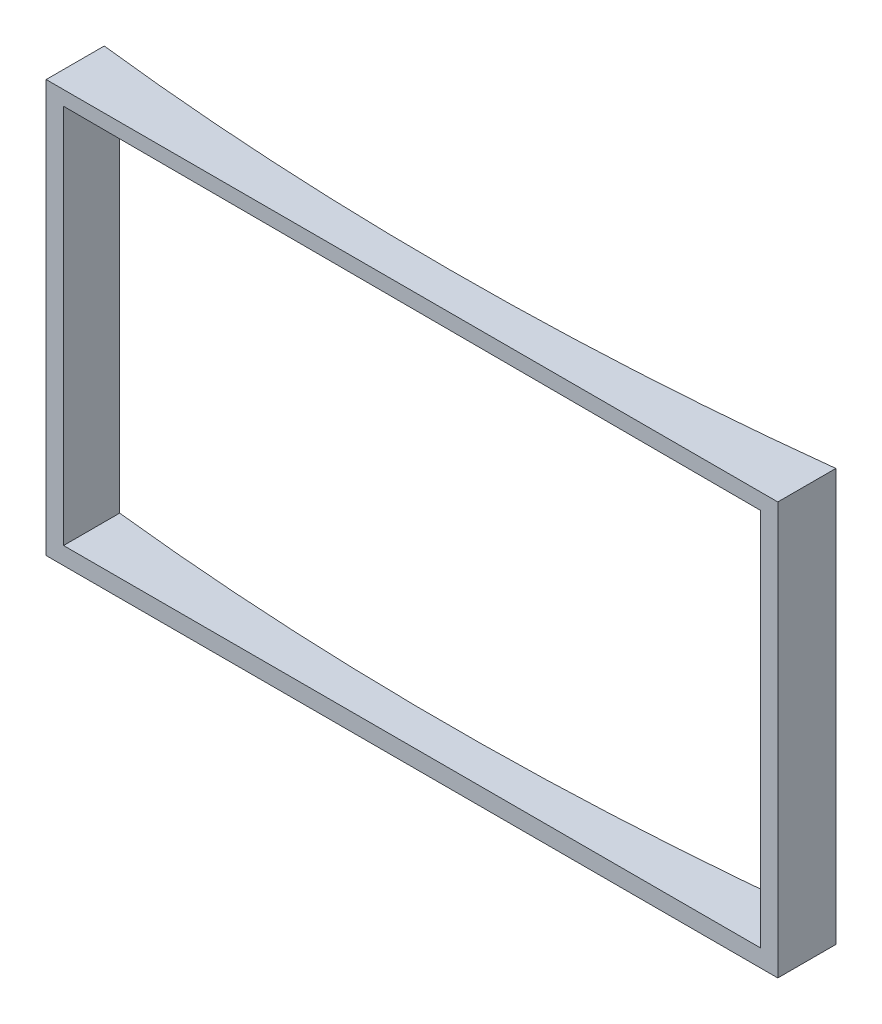
ISO-10303-21;
HEADER;
FILE_DESCRIPTION(('STEP AP214'),'2;1');
FILE_NAME('part.step','',(''),(''),'','','');
FILE_SCHEMA(('AUTOMOTIVE_DESIGN { 1 0 10303 214 1 1 1 1 }'));
ENDSEC;
DATA;
#1=APPLICATION_CONTEXT('core data for automotive mechanical design processes');
#2=APPLICATION_PROTOCOL_DEFINITION('international standard','automotive_design',2000,#1);
#3=PRODUCT_CONTEXT('',#1,'mechanical');
#4=PRODUCT('Part','Part','',(#3));
#5=PRODUCT_RELATED_PRODUCT_CATEGORY('part','',(#4));
#6=PRODUCT_DEFINITION_FORMATION('','',#4);
#7=PRODUCT_DEFINITION_CONTEXT('part definition',#1,'design');
#8=PRODUCT_DEFINITION('design','',#6,#7);
#9=PRODUCT_DEFINITION_SHAPE('','',#8);
#10=(LENGTH_UNIT() NAMED_UNIT(*) SI_UNIT(.MILLI.,.METRE.));
#11=(NAMED_UNIT(*) PLANE_ANGLE_UNIT() SI_UNIT($,.RADIAN.));
#12=(NAMED_UNIT(*) SI_UNIT($,.STERADIAN.) SOLID_ANGLE_UNIT());
#13=UNCERTAINTY_MEASURE_WITH_UNIT(LENGTH_MEASURE(1.E-05),#10,'distance_accuracy_value','');
#14=(GEOMETRIC_REPRESENTATION_CONTEXT(3) GLOBAL_UNCERTAINTY_ASSIGNED_CONTEXT((#13)) GLOBAL_UNIT_ASSIGNED_CONTEXT((#10,
#11,#12)) REPRESENTATION_CONTEXT('',''));
#15=CARTESIAN_POINT('',(0.,0.,0.));
#16=DIRECTION('',(0.,0.,1.));
#17=DIRECTION('',(1.,0.,0.));
#18=AXIS2_PLACEMENT_3D('',#15,#16,#17);
#19=CARTESIAN_POINT('',(8890.54648049518,3550.,3013.60985692235));
#20=DIRECTION('',(-1.,0.,0.));
#21=DIRECTION('',(0.,0.,1.));
#22=AXIS2_PLACEMENT_3D('',#19,#20,#21);
#23=PLANE('',#22);
#24=DIRECTION('',(0.,0.,-1.));
#25=VECTOR('',#24,1.);
#26=CARTESIAN_POINT('',(8890.54648049518,0.,3013.60985692235));
#27=LINE('',#26,#25);
#28=CARTESIAN_POINT('',(8890.54648049518,0.,3013.60985692235));
#29=VERTEX_POINT('',#28);
#30=CARTESIAN_POINT('',(8890.54648049518,0.,2513.60985692235));
#31=VERTEX_POINT('',#30);
#32=EDGE_CURVE('E158',#29,#31,#27,.T.);
#33=ORIENTED_EDGE('',*,*,#32,.T.);
#34=DIRECTION('',(0.,-1.,0.));
#35=VECTOR('',#34,1.);
#36=CARTESIAN_POINT('',(8890.54648049518,3550.,2513.60985692235));
#37=LINE('',#36,#35);
#38=CARTESIAN_POINT('',(8890.54648049518,3550.,2513.60985692235));
#39=VERTEX_POINT('',#38);
#40=EDGE_CURVE('E11',#39,#31,#37,.T.);
#41=ORIENTED_EDGE('',*,*,#40,.F.);
#42=DIRECTION('',(0.,0.,-1.));
#43=VECTOR('',#42,1.);
#44=CARTESIAN_POINT('',(8890.54648049518,3550.,3013.60985692235));
#45=LINE('',#44,#43);
#46=CARTESIAN_POINT('',(8890.54648049518,3550.,3013.60985692235));
#47=VERTEX_POINT('',#46);
#48=EDGE_CURVE('E159',#47,#39,#45,.T.);
#49=ORIENTED_EDGE('',*,*,#48,.F.);
#50=DIRECTION('',(0.,-1.,0.));
#51=VECTOR('',#50,1.);
#52=CARTESIAN_POINT('',(8890.54648049518,3550.,3013.60985692235));
#53=LINE('',#52,#51);
#54=EDGE_CURVE('E173',#47,#29,#53,.T.);
#55=ORIENTED_EDGE('',*,*,#54,.T.);
#56=EDGE_LOOP('',(#33,#41,#49,#55));
#57=FACE_BOUND('',#56,.T.);
#58=ADVANCED_FACE('F45',(#57),#23,.F.);
#59=CARTESIAN_POINT('',(5740.54648049518,3550.,-24805.385366182));
#60=DIRECTION('',(0.,-1.,0.));
#61=DIRECTION('',(0.,0.,-1.));
#62=AXIS2_PLACEMENT_3D('',#59,#60,#61);
#63=CYLINDRICAL_SURFACE('',#62,27500.);
#64=CARTESIAN_POINT('',(5740.54648049518,150.,-24805.385366182));
#65=DIRECTION('',(0.,-1.,0.));
#66=DIRECTION('',(1.,0.,0.));
#67=AXIS2_PLACEMENT_3D('',#64,#65,#66);
#68=CIRCLE('',#67,27500.);
#69=CARTESIAN_POINT('',(2740.54648049518,150.,2530.48849949126));
#70=VERTEX_POINT('',#69);
#71=CARTESIAN_POINT('',(8740.54648049518,150.,2530.48849949126));
#72=VERTEX_POINT('',#71);
#73=EDGE_CURVE('E150',#70,#72,#68,.F.);
#74=ORIENTED_EDGE('',*,*,#73,.T.);
#75=DIRECTION('',(0.,-1.,0.));
#76=VECTOR('',#75,1.);
#77=CARTESIAN_POINT('',(8740.54648049518,3550.,2530.48849949126));
#78=LINE('',#77,#76);
#79=CARTESIAN_POINT('',(8740.54648049518,3412.63855525021,2530.48849949125));
#80=VERTEX_POINT('',#79);
#81=EDGE_CURVE('E154',#72,#80,#78,.F.);
#82=ORIENTED_EDGE('',*,*,#81,.T.);
#83=CARTESIAN_POINT('',(5740.54648049518,3419.1282100401,-24805.385366182));
#84=DIRECTION('',(0.00216321320190937,0.999997660251584,0.));
#85=DIRECTION('',(0.999997660251584,-0.00216321320190937,0.));
#86=AXIS2_PLACEMENT_3D('',#83,#84,#85);
#87=ELLIPSE('',#86,27500.064343232,27500.);
#88=CARTESIAN_POINT('',(2740.54648049518,3425.61786482999,2530.48849949125));
#89=VERTEX_POINT('',#88);
#90=EDGE_CURVE('E141',#80,#89,#87,.F.);
#91=ORIENTED_EDGE('',*,*,#90,.T.);
#92=DIRECTION('',(0.,-1.,0.));
#93=VECTOR('',#92,1.);
#94=CARTESIAN_POINT('',(2740.54648049518,3550.,2530.48849949126));
#95=LINE('',#94,#93);
#96=EDGE_CURVE('E116',#89,#70,#95,.T.);
#97=ORIENTED_EDGE('',*,*,#96,.T.);
#98=EDGE_LOOP('',(#74,#82,#91,#97));
#99=FACE_BOUND('',#98,.T.);
#100=CARTESIAN_POINT('',(5740.54648049518,0.,-24805.385366182));
#101=DIRECTION('',(0.,-1.,0.));
#102=DIRECTION('',(0.,0.,1.));
#103=AXIS2_PLACEMENT_3D('',#100,#101,#102);
#104=CIRCLE('',#103,27500.);
#105=CARTESIAN_POINT('',(2590.54648049518,0.,2513.60985692235));
#106=VERTEX_POINT('',#105);
#107=EDGE_CURVE('E177',#31,#106,#104,.T.);
#108=ORIENTED_EDGE('',*,*,#107,.T.);
#109=DIRECTION('',(0.,-1.,0.));
#110=VECTOR('',#109,1.);
#111=CARTESIAN_POINT('',(2590.54648049518,3550.,2513.60985692235));
#112=LINE('',#111,#110);
#113=CARTESIAN_POINT('',(2590.54648049518,3550.,2513.60985692235));
#114=VERTEX_POINT('',#113);
#115=EDGE_CURVE('E53',#114,#106,#112,.T.);
#116=ORIENTED_EDGE('',*,*,#115,.F.);
#117=CARTESIAN_POINT('',(5740.54648049518,3550.,-24805.385366182));
#118=DIRECTION('',(0.,-1.,0.));
#119=DIRECTION('',(0.,0.,1.));
#120=AXIS2_PLACEMENT_3D('',#117,#118,#119);
#121=CIRCLE('',#120,27500.);
#122=EDGE_CURVE('E163',#39,#114,#121,.T.);
#123=ORIENTED_EDGE('',*,*,#122,.F.);
#124=ORIENTED_EDGE('',*,*,#40,.T.);
#125=EDGE_LOOP('',(#108,#116,#123,#124));
#126=FACE_BOUND('',#125,.T.);
#127=ADVANCED_FACE('F211',(#99,#126),#63,.F.);
#128=CARTESIAN_POINT('',(2590.54648049518,3550.,3013.60985692235));
#129=DIRECTION('',(1.,0.,0.));
#130=DIRECTION('',(0.,0.,-1.));
#131=AXIS2_PLACEMENT_3D('',#128,#129,#130);
#132=PLANE('',#131);
#133=DIRECTION('',(0.,0.,1.));
#134=VECTOR('',#133,1.);
#135=CARTESIAN_POINT('',(2590.54648049518,0.,3013.60985692235));
#136=LINE('',#135,#134);
#137=CARTESIAN_POINT('',(2590.54648049518,0.,3013.60985692235));
#138=VERTEX_POINT('',#137);
#139=EDGE_CURVE('E180',#106,#138,#136,.T.);
#140=ORIENTED_EDGE('',*,*,#139,.T.);
#141=DIRECTION('',(0.,-1.,0.));
#142=VECTOR('',#141,1.);
#143=CARTESIAN_POINT('',(2590.54648049518,3550.,3013.60985692235));
#144=LINE('',#143,#142);
#145=CARTESIAN_POINT('',(2590.54648049518,3550.,3013.60985692235));
#146=VERTEX_POINT('',#145);
#147=EDGE_CURVE('E188',#146,#138,#144,.T.);
#148=ORIENTED_EDGE('',*,*,#147,.F.);
#149=DIRECTION('',(0.,0.,1.));
#150=VECTOR('',#149,1.);
#151=CARTESIAN_POINT('',(2590.54648049518,3550.,3013.60985692235));
#152=LINE('',#151,#150);
#153=EDGE_CURVE('E167',#114,#146,#152,.T.);
#154=ORIENTED_EDGE('',*,*,#153,.F.);
#155=ORIENTED_EDGE('',*,*,#115,.T.);
#156=EDGE_LOOP('',(#140,#148,#154,#155));
#157=FACE_BOUND('',#156,.T.);
#158=ADVANCED_FACE('F197',(#157),#132,.F.);
#159=CARTESIAN_POINT('',(2590.54648049518,3550.,3013.60985692235));
#160=DIRECTION('',(0.,0.,-1.));
#161=DIRECTION('',(-1.,0.,0.));
#162=AXIS2_PLACEMENT_3D('',#159,#160,#161);
#163=PLANE('',#162);
#164=DIRECTION('',(-0.999997660251584,0.00216321320190937,0.));
#165=VECTOR('',#164,1.);
#166=CARTESIAN_POINT('',(2740.54648049518,3425.61786482999,3013.60985692235));
#167=LINE('',#166,#165);
#168=CARTESIAN_POINT('',(8740.54648049518,3412.63855525021,3013.60985692235));
#169=VERTEX_POINT('',#168);
#170=CARTESIAN_POINT('',(2740.54648049518,3425.61786482999,3013.60985692235));
#171=VERTEX_POINT('',#170);
#172=EDGE_CURVE('E123',#169,#171,#167,.T.);
#173=ORIENTED_EDGE('',*,*,#172,.F.);
#174=DIRECTION('',(0.,1.,0.));
#175=VECTOR('',#174,1.);
#176=CARTESIAN_POINT('',(8740.54648049518,3412.63855525021,3013.60985692235));
#177=LINE('',#176,#175);
#178=CARTESIAN_POINT('',(8740.54648049518,150.,3013.60985692235));
#179=VERTEX_POINT('',#178);
#180=EDGE_CURVE('E68',#179,#169,#177,.T.);
#181=ORIENTED_EDGE('',*,*,#180,.F.);
#182=DIRECTION('',(1.,0.,0.));
#183=VECTOR('',#182,1.);
#184=CARTESIAN_POINT('',(8740.54648049518,150.,3013.60985692235));
#185=LINE('',#184,#183);
#186=CARTESIAN_POINT('',(2740.54648049518,150.,3013.60985692235));
#187=VERTEX_POINT('',#186);
#188=EDGE_CURVE('E131',#187,#179,#185,.T.);
#189=ORIENTED_EDGE('',*,*,#188,.F.);
#190=DIRECTION('',(0.,-1.,0.));
#191=VECTOR('',#190,1.);
#192=CARTESIAN_POINT('',(2740.54648049518,150.,3013.60985692235));
#193=LINE('',#192,#191);
#194=EDGE_CURVE('E113',#171,#187,#193,.T.);
#195=ORIENTED_EDGE('',*,*,#194,.F.);
#196=EDGE_LOOP('',(#173,#181,#189,#195));
#197=FACE_BOUND('',#196,.T.);
#198=DIRECTION('',(1.,0.,0.));
#199=VECTOR('',#198,1.);
#200=CARTESIAN_POINT('',(2590.54648049518,0.,3013.60985692235));
#201=LINE('',#200,#199);
#202=EDGE_CURVE('E164',#138,#29,#201,.T.);
#203=ORIENTED_EDGE('',*,*,#202,.T.);
#204=ORIENTED_EDGE('',*,*,#54,.F.);
#205=DIRECTION('',(1.,0.,0.));
#206=VECTOR('',#205,1.);
#207=CARTESIAN_POINT('',(2590.54648049518,3550.,3013.60985692235));
#208=LINE('',#207,#206);
#209=EDGE_CURVE('E170',#146,#47,#208,.T.);
#210=ORIENTED_EDGE('',*,*,#209,.F.);
#211=ORIENTED_EDGE('',*,*,#147,.T.);
#212=EDGE_LOOP('',(#203,#204,#210,#211));
#213=FACE_BOUND('',#212,.T.);
#214=ADVANCED_FACE('F128',(#197,#213),#163,.F.);
#215=CARTESIAN_POINT('',(5740.54648049518,3550.,-24805.385366182));
#216=DIRECTION('',(0.,1.,0.));
#217=DIRECTION('',(0.,0.,1.));
#218=AXIS2_PLACEMENT_3D('',#215,#216,#217);
#219=PLANE('',#218);
#220=ORIENTED_EDGE('',*,*,#48,.T.);
#221=ORIENTED_EDGE('',*,*,#122,.T.);
#222=ORIENTED_EDGE('',*,*,#153,.T.);
#223=ORIENTED_EDGE('',*,*,#209,.T.);
#224=EDGE_LOOP('',(#220,#221,#222,#223));
#225=FACE_BOUND('',#224,.T.);
#226=ADVANCED_FACE('F210',(#225),#219,.T.);
#227=CARTESIAN_POINT('',(5740.54648049518,0.,-24805.385366182));
#228=DIRECTION('',(0.,1.,0.));
#229=DIRECTION('',(0.,0.,1.));
#230=AXIS2_PLACEMENT_3D('',#227,#228,#229);
#231=PLANE('',#230);
#232=ORIENTED_EDGE('',*,*,#32,.F.);
#233=ORIENTED_EDGE('',*,*,#202,.F.);
#234=ORIENTED_EDGE('',*,*,#139,.F.);
#235=ORIENTED_EDGE('',*,*,#107,.F.);
#236=EDGE_LOOP('',(#232,#233,#234,#235));
#237=FACE_BOUND('',#236,.T.);
#238=ADVANCED_FACE('F203',(#237),#231,.F.);
#239=CARTESIAN_POINT('',(8740.54648049518,3412.63855525021,-2986.39014307765));
#240=DIRECTION('',(1.,0.,0.));
#241=DIRECTION('',(0.,0.,-1.));
#242=AXIS2_PLACEMENT_3D('',#239,#240,#241);
#243=PLANE('',#242);
#244=DIRECTION('',(0.,0.,1.));
#245=VECTOR('',#244,1.);
#246=CARTESIAN_POINT('',(8740.54648049518,150.,-2986.39014307765));
#247=LINE('',#246,#245);
#248=EDGE_CURVE('E138',#72,#179,#247,.T.);
#249=ORIENTED_EDGE('',*,*,#248,.T.);
#250=ORIENTED_EDGE('',*,*,#180,.T.);
#251=DIRECTION('',(0.,0.,1.));
#252=VECTOR('',#251,1.);
#253=CARTESIAN_POINT('',(8740.54648049518,3412.63855525021,-2986.39014307765));
#254=LINE('',#253,#252);
#255=EDGE_CURVE('E120',#80,#169,#254,.T.);
#256=ORIENTED_EDGE('',*,*,#255,.F.);
#257=ORIENTED_EDGE('',*,*,#81,.F.);
#258=EDGE_LOOP('',(#249,#250,#256,#257));
#259=FACE_BOUND('',#258,.T.);
#260=ADVANCED_FACE('F224',(#259),#243,.F.);
#261=CARTESIAN_POINT('',(8740.54648049518,150.,-2986.39014307765));
#262=DIRECTION('',(0.,-1.,0.));
#263=DIRECTION('',(1.,0.,0.));
#264=AXIS2_PLACEMENT_3D('',#261,#262,#263);
#265=PLANE('',#264);
#266=DIRECTION('',(0.,0.,1.));
#267=VECTOR('',#266,1.);
#268=CARTESIAN_POINT('',(2740.54648049518,150.,-2986.39014307765));
#269=LINE('',#268,#267);
#270=EDGE_CURVE('E119',#70,#187,#269,.T.);
#271=ORIENTED_EDGE('',*,*,#270,.T.);
#272=ORIENTED_EDGE('',*,*,#188,.T.);
#273=ORIENTED_EDGE('',*,*,#248,.F.);
#274=ORIENTED_EDGE('',*,*,#73,.F.);
#275=EDGE_LOOP('',(#271,#272,#273,#274));
#276=FACE_BOUND('',#275,.T.);
#277=ADVANCED_FACE('F229',(#276),#265,.F.);
#278=CARTESIAN_POINT('',(2740.54648049518,150.,-2986.39014307765));
#279=DIRECTION('',(-1.,0.,0.));
#280=DIRECTION('',(0.,-1.,0.));
#281=AXIS2_PLACEMENT_3D('',#278,#279,#280);
#282=PLANE('',#281);
#283=DIRECTION('',(0.,0.,1.));
#284=VECTOR('',#283,1.);
#285=CARTESIAN_POINT('',(2740.54648049518,3425.61786482999,-2986.39014307765));
#286=LINE('',#285,#284);
#287=EDGE_CURVE('E60',#89,#171,#286,.T.);
#288=ORIENTED_EDGE('',*,*,#287,.T.);
#289=ORIENTED_EDGE('',*,*,#194,.T.);
#290=ORIENTED_EDGE('',*,*,#270,.F.);
#291=ORIENTED_EDGE('',*,*,#96,.F.);
#292=EDGE_LOOP('',(#288,#289,#290,#291));
#293=FACE_BOUND('',#292,.T.);
#294=ADVANCED_FACE('F110',(#293),#282,.F.);
#295=CARTESIAN_POINT('',(2740.54648049518,3425.61786482999,-2986.39014307765));
#296=DIRECTION('',(0.00216321320190937,0.999997660251584,0.));
#297=DIRECTION('',(-0.999997660251584,0.00216321320190937,0.));
#298=AXIS2_PLACEMENT_3D('',#295,#296,#297);
#299=PLANE('',#298);
#300=ORIENTED_EDGE('',*,*,#255,.T.);
#301=ORIENTED_EDGE('',*,*,#172,.T.);
#302=ORIENTED_EDGE('',*,*,#287,.F.);
#303=ORIENTED_EDGE('',*,*,#90,.F.);
#304=EDGE_LOOP('',(#300,#301,#302,#303));
#305=FACE_BOUND('',#304,.T.);
#306=ADVANCED_FACE('F124',(#305),#299,.F.);
#307=CLOSED_SHELL('',(#58,#127,#158,#214,#226,#238,#260,#277,#294,#306));
#308=MANIFOLD_SOLID_BREP('B2',#307);
#309=ADVANCED_BREP_SHAPE_REPRESENTATION('',(#18,#308),#14);
#310=SHAPE_DEFINITION_REPRESENTATION(#9,#309);
ENDSEC;
END-ISO-10303-21;
